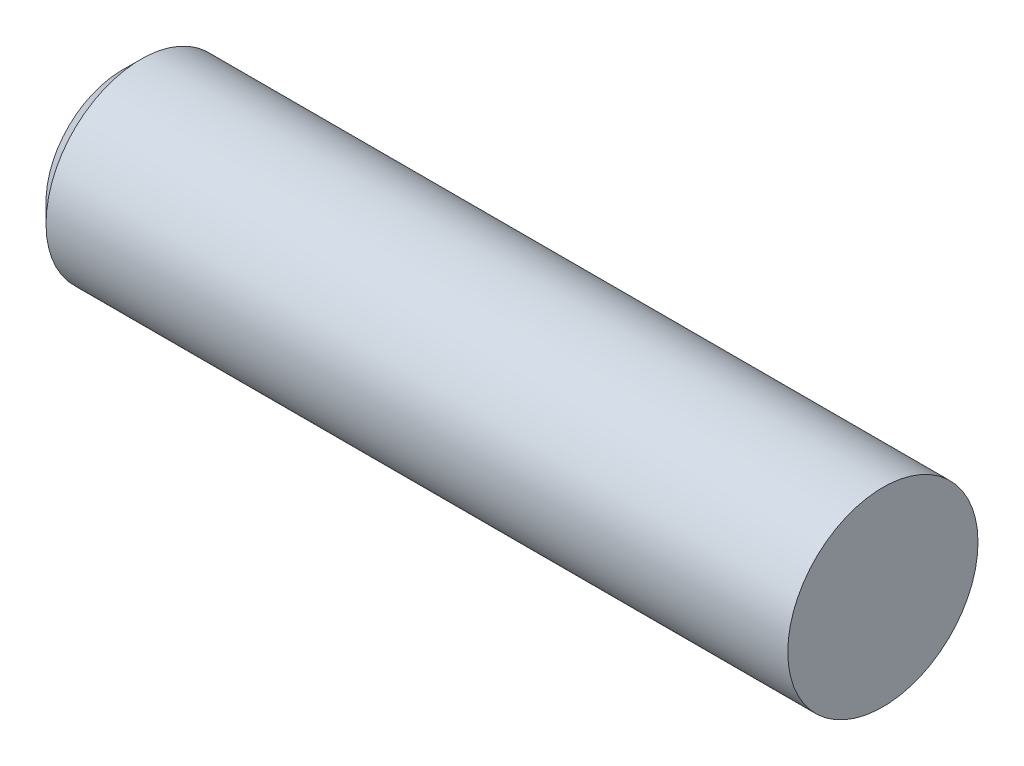
ISO-10303-21;
HEADER;
FILE_DESCRIPTION(('STEP AP214'),'2;1');
FILE_NAME('part.step','',(''),(''),'','','');
FILE_SCHEMA(('AUTOMOTIVE_DESIGN { 1 0 10303 214 1 1 1 1 }'));
ENDSEC;
DATA;
#1=APPLICATION_CONTEXT('core data for automotive mechanical design processes');
#2=APPLICATION_PROTOCOL_DEFINITION('international standard','automotive_design',2000,#1);
#3=PRODUCT_CONTEXT('',#1,'mechanical');
#4=PRODUCT('Part','Part','',(#3));
#5=PRODUCT_RELATED_PRODUCT_CATEGORY('part','',(#4));
#6=PRODUCT_DEFINITION_FORMATION('','',#4);
#7=PRODUCT_DEFINITION_CONTEXT('part definition',#1,'design');
#8=PRODUCT_DEFINITION('design','',#6,#7);
#9=PRODUCT_DEFINITION_SHAPE('','',#8);
#10=(LENGTH_UNIT() NAMED_UNIT(*) SI_UNIT(.MILLI.,.METRE.));
#11=(NAMED_UNIT(*) PLANE_ANGLE_UNIT() SI_UNIT($,.RADIAN.));
#12=(NAMED_UNIT(*) SI_UNIT($,.STERADIAN.) SOLID_ANGLE_UNIT());
#13=UNCERTAINTY_MEASURE_WITH_UNIT(LENGTH_MEASURE(1.E-05),#10,'distance_accuracy_value','');
#14=(GEOMETRIC_REPRESENTATION_CONTEXT(3) GLOBAL_UNCERTAINTY_ASSIGNED_CONTEXT((#13)) GLOBAL_UNIT_ASSIGNED_CONTEXT((#10,
#11,#12)) REPRESENTATION_CONTEXT('',''));
#15=CARTESIAN_POINT('',(0.,0.,0.));
#16=DIRECTION('',(0.,0.,1.));
#17=DIRECTION('',(1.,0.,0.));
#18=AXIS2_PLACEMENT_3D('',#15,#16,#17);
#19=CARTESIAN_POINT('',(-6.35,0.,0.));
#20=DIRECTION('',(1.,0.,0.));
#21=DIRECTION('',(0.,0.,-1.));
#22=AXIS2_PLACEMENT_3D('',#19,#20,#21);
#23=CYLINDRICAL_SURFACE('',#22,1.5875);
#24=CARTESIAN_POINT('',(6.35,0.,0.));
#25=DIRECTION('',(1.,0.,0.));
#26=DIRECTION('',(0.,0.,-1.));
#27=AXIS2_PLACEMENT_3D('',#24,#25,#26);
#28=CIRCLE('',#27,1.5875);
#29=CARTESIAN_POINT('',(6.35,0.,-1.5875));
#30=VERTEX_POINT('',#29);
#31=EDGE_CURVE('E33',#30,#30,#28,.T.);
#32=ORIENTED_EDGE('',*,*,#31,.F.);
#33=EDGE_LOOP('',(#32));
#34=FACE_BOUND('',#33,.T.);
#35=CARTESIAN_POINT('',(-6.0325,0.,0.));
#36=DIRECTION('',(1.,0.,0.));
#37=DIRECTION('',(0.,0.,-1.));
#38=AXIS2_PLACEMENT_3D('',#35,#36,#37);
#39=CIRCLE('',#38,1.5875);
#40=CARTESIAN_POINT('',(-6.0325,0.,-1.5875));
#41=VERTEX_POINT('',#40);
#42=EDGE_CURVE('E37',#41,#41,#39,.T.);
#43=ORIENTED_EDGE('',*,*,#42,.T.);
#44=EDGE_LOOP('',(#43));
#45=FACE_BOUND('',#44,.T.);
#46=ADVANCED_FACE('F30',(#34,#45),#23,.T.);
#47=CARTESIAN_POINT('',(-6.35,0.,0.));
#48=DIRECTION('',(1.,0.,0.));
#49=DIRECTION('',(0.,0.,-1.));
#50=AXIS2_PLACEMENT_3D('',#47,#48,#49);
#51=PLANE('',#50);
#52=CARTESIAN_POINT('',(-6.35,0.,0.));
#53=DIRECTION('',(1.,0.,0.));
#54=DIRECTION('',(0.,0.,-1.));
#55=AXIS2_PLACEMENT_3D('',#52,#53,#54);
#56=CIRCLE('',#55,1.27);
#57=CARTESIAN_POINT('',(-6.35,0.,-1.27));
#58=VERTEX_POINT('',#57);
#59=EDGE_CURVE('E10',#58,#58,#56,.F.);
#60=ORIENTED_EDGE('',*,*,#59,.T.);
#61=EDGE_LOOP('',(#60));
#62=FACE_BOUND('',#61,.T.);
#63=ADVANCED_FACE('F50',(#62),#51,.F.);
#64=CARTESIAN_POINT('',(6.35,0.,0.));
#65=DIRECTION('',(1.,0.,0.));
#66=DIRECTION('',(0.,0.,-1.));
#67=AXIS2_PLACEMENT_3D('',#64,#65,#66);
#68=PLANE('',#67);
#69=ORIENTED_EDGE('',*,*,#31,.T.);
#70=EDGE_LOOP('',(#69));
#71=FACE_BOUND('',#70,.T.);
#72=ADVANCED_FACE('F47',(#71),#68,.T.);
#73=CARTESIAN_POINT('',(-6.0325,0.,0.));
#74=DIRECTION('',(1.,0.,0.));
#75=DIRECTION('',(0.,0.,-1.));
#76=AXIS2_PLACEMENT_3D('',#73,#74,#75);
#77=CONICAL_SURFACE('',#76,1.5875,0.78539816339745);
#78=CARTESIAN_POINT('',(-6.35,0.,-1.27));
#79=CARTESIAN_POINT('',(-6.34669270833334,0.,-1.27330729166666));
#80=CARTESIAN_POINT('',(-6.34338541666667,0.,-1.27661458333333));
#81=CARTESIAN_POINT('',(-6.33677083333334,0.,-1.28322916666666));
#82=CARTESIAN_POINT('',(-6.33346354166667,0.,-1.28653645833333));
#83=CARTESIAN_POINT('',(-6.32684895833333,0.,-1.29315104166666));
#84=CARTESIAN_POINT('',(-6.32354166666667,0.,-1.29645833333333));
#85=CARTESIAN_POINT('',(-6.31692708333333,0.,-1.30307291666666));
#86=CARTESIAN_POINT('',(-6.31361979166667,0.,-1.30638020833333));
#87=CARTESIAN_POINT('',(-6.30700520833333,0.,-1.31299479166666));
#88=CARTESIAN_POINT('',(-6.30369791666667,0.,-1.31630208333333));
#89=CARTESIAN_POINT('',(-6.29708333333333,0.,-1.32291666666666));
#90=CARTESIAN_POINT('',(-6.29377604166667,0.,-1.32622395833333));
#91=CARTESIAN_POINT('',(-6.28716145833334,0.,-1.33283854166666));
#92=CARTESIAN_POINT('',(-6.28385416666667,0.,-1.33614583333333));
#93=CARTESIAN_POINT('',(-6.27723958333333,0.,-1.34276041666666));
#94=CARTESIAN_POINT('',(-6.27393229166667,0.,-1.34606770833333));
#95=CARTESIAN_POINT('',(-6.26731770833333,0.,-1.35268229166666));
#96=CARTESIAN_POINT('',(-6.26401041666667,0.,-1.35598958333333));
#97=CARTESIAN_POINT('',(-6.25739583333333,0.,-1.36260416666666));
#98=CARTESIAN_POINT('',(-6.25408854166667,0.,-1.36591145833333));
#99=CARTESIAN_POINT('',(-6.24747395833333,0.,-1.37252604166666));
#100=CARTESIAN_POINT('',(-6.24416666666667,0.,-1.37583333333333));
#101=CARTESIAN_POINT('',(-6.23755208333333,0.,-1.38244791666666));
#102=CARTESIAN_POINT('',(-6.23424479166667,0.,-1.38575520833333));
#103=CARTESIAN_POINT('',(-6.22763020833333,0.,-1.39236979166666));
#104=CARTESIAN_POINT('',(-6.22432291666667,0.,-1.39567708333333));
#105=CARTESIAN_POINT('',(-6.21770833333333,0.,-1.40229166666666));
#106=CARTESIAN_POINT('',(-6.21440104166667,0.,-1.40559895833333));
#107=CARTESIAN_POINT('',(-6.20778645833333,0.,-1.41221354166666));
#108=CARTESIAN_POINT('',(-6.20447916666667,0.,-1.41552083333333));
#109=CARTESIAN_POINT('',(-6.19786458333333,0.,-1.42213541666666));
#110=CARTESIAN_POINT('',(-6.19455729166667,0.,-1.42544270833333));
#111=CARTESIAN_POINT('',(-6.18794270833333,0.,-1.43205729166666));
#112=CARTESIAN_POINT('',(-6.18463541666667,0.,-1.43536458333333));
#113=CARTESIAN_POINT('',(-6.17802083333333,0.,-1.44197916666667));
#114=CARTESIAN_POINT('',(-6.17471354166667,0.,-1.44528645833333));
#115=CARTESIAN_POINT('',(-6.16809895833333,0.,-1.45190104166667));
#116=CARTESIAN_POINT('',(-6.16479166666667,0.,-1.45520833333333));
#117=CARTESIAN_POINT('',(-6.15817708333333,0.,-1.46182291666667));
#118=CARTESIAN_POINT('',(-6.15486979166667,0.,-1.46513020833333));
#119=CARTESIAN_POINT('',(-6.14825520833333,0.,-1.47174479166667));
#120=CARTESIAN_POINT('',(-6.14494791666667,0.,-1.47505208333333));
#121=CARTESIAN_POINT('',(-6.13833333333333,0.,-1.48166666666667));
#122=CARTESIAN_POINT('',(-6.13502604166667,0.,-1.48497395833333));
#123=CARTESIAN_POINT('',(-6.12841145833333,0.,-1.49158854166667));
#124=CARTESIAN_POINT('',(-6.12510416666667,0.,-1.49489583333333));
#125=CARTESIAN_POINT('',(-6.11848958333333,0.,-1.50151041666667));
#126=CARTESIAN_POINT('',(-6.11518229166667,0.,-1.50481770833333));
#127=CARTESIAN_POINT('',(-6.10856770833333,0.,-1.51143229166667));
#128=CARTESIAN_POINT('',(-6.10526041666667,0.,-1.51473958333333));
#129=CARTESIAN_POINT('',(-6.09864583333333,0.,-1.52135416666667));
#130=CARTESIAN_POINT('',(-6.09533854166667,0.,-1.52466145833333));
#131=CARTESIAN_POINT('',(-6.08872395833333,0.,-1.53127604166667));
#132=CARTESIAN_POINT('',(-6.08541666666667,0.,-1.53458333333333));
#133=CARTESIAN_POINT('',(-6.07880208333333,0.,-1.54119791666667));
#134=CARTESIAN_POINT('',(-6.07549479166667,0.,-1.54450520833333));
#135=CARTESIAN_POINT('',(-6.06888020833333,0.,-1.55111979166667));
#136=CARTESIAN_POINT('',(-6.06557291666667,0.,-1.55442708333333));
#137=CARTESIAN_POINT('',(-6.05895833333333,0.,-1.56104166666667));
#138=CARTESIAN_POINT('',(-6.05565104166667,0.,-1.56434895833333));
#139=CARTESIAN_POINT('',(-6.04903645833333,0.,-1.57096354166667));
#140=CARTESIAN_POINT('',(-6.04572916666667,0.,-1.57427083333333));
#141=CARTESIAN_POINT('',(-6.03911458333333,0.,-1.58088541666667));
#142=CARTESIAN_POINT('',(-6.03580729166667,0.,-1.58419270833333));
#143=CARTESIAN_POINT('',(-6.0325,0.,-1.5875));
#144=B_SPLINE_CURVE_WITH_KNOTS('',3,(#78,#79,#80,#81,#82,#83,#84,#85,#86,#87,#88,#89,#90,#91,
#92,#93,#94,#95,#96,#97,#98,#99,#100,#101,#102,#103,#104,#105,#106,#107,#108,#109,#110,#111,
#112,#113,#114,#115,#116,#117,#118,#119,#120,#121,#122,#123,#124,#125,#126,#127,#128,#129,#130,
#131,#132,#133,#134,#135,#136,#137,#138,#139,#140,#141,#142,#143),.UNSPECIFIED.,.F.,.F.,(4,2,2,
2,2,2,2,2,2,2,2,2,2,2,2,2,2,2,2,2,2,2,2,2,2,2,2,2,2,2,2,2,4),(0.,0.0140316501891712,
0.0280633003783417,0.0420949505675124,0.056126600756683,0.0701582509458536,0.0841899011350243,
0.0982215513241954,0.112253201513366,0.126284851702537,0.140316501891707,0.154348152080878,
0.168379802270049,0.182411452459219,0.19644310264839,0.210474752837561,0.224506403026732,
0.238538053215902,0.252569703405073,0.266601353594243,0.280633003783415,0.294664653972585,
0.308696304161756,0.322727954350926,0.336759604540097,0.350791254729268,0.364822904918439,
0.378854555107609,0.39288620529678,0.406917855485951,0.420949505675121,0.434981155864292,
0.449012806053463),.UNSPECIFIED.);
#145=EDGE_CURVE('BSEAM58',#58,#41,#144,.T.);
#146=ORIENTED_EDGE('',*,*,#59,.F.);
#147=ORIENTED_EDGE('',*,*,#42,.F.);
#148=ORIENTED_EDGE('',*,*,#145,.T.);
#149=ORIENTED_EDGE('',*,*,#145,.F.);
#150=EDGE_LOOP('',(#146,#148,#147,#149));
#151=FACE_BOUND('',#150,.T.);
#152=ADVANCED_FACE('F58',(#151),#77,.T.);
#153=CLOSED_SHELL('',(#46,#63,#72,#152));
#154=MANIFOLD_SOLID_BREP('B2',#153);
#155=ADVANCED_BREP_SHAPE_REPRESENTATION('',(#18,#154),#14);
#156=SHAPE_DEFINITION_REPRESENTATION(#9,#155);
ENDSEC;
END-ISO-10303-21;
